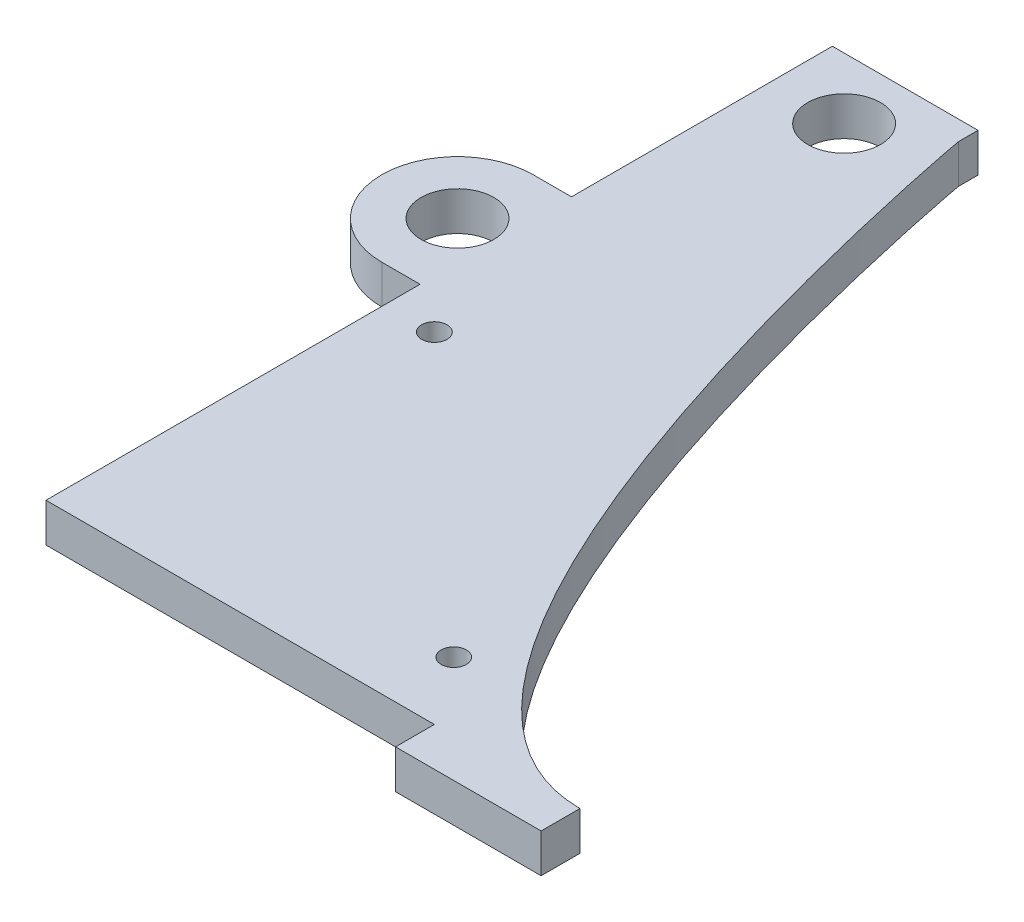
ISO-10303-21;
HEADER;
FILE_DESCRIPTION(('STEP AP214'),'2;1');
FILE_NAME('part.step','',(''),(''),'','','');
FILE_SCHEMA(('AUTOMOTIVE_DESIGN { 1 0 10303 214 1 1 1 1 }'));
ENDSEC;
DATA;
#1=APPLICATION_CONTEXT('core data for automotive mechanical design processes');
#2=APPLICATION_PROTOCOL_DEFINITION('international standard','automotive_design',2000,#1);
#3=PRODUCT_CONTEXT('',#1,'mechanical');
#4=PRODUCT('Part','Part','',(#3));
#5=PRODUCT_RELATED_PRODUCT_CATEGORY('part','',(#4));
#6=PRODUCT_DEFINITION_FORMATION('','',#4);
#7=PRODUCT_DEFINITION_CONTEXT('part definition',#1,'design');
#8=PRODUCT_DEFINITION('design','',#6,#7);
#9=PRODUCT_DEFINITION_SHAPE('','',#8);
#10=(LENGTH_UNIT() NAMED_UNIT(*) SI_UNIT(.MILLI.,.METRE.));
#11=(NAMED_UNIT(*) PLANE_ANGLE_UNIT() SI_UNIT($,.RADIAN.));
#12=(NAMED_UNIT(*) SI_UNIT($,.STERADIAN.) SOLID_ANGLE_UNIT());
#13=UNCERTAINTY_MEASURE_WITH_UNIT(LENGTH_MEASURE(1.E-05),#10,'distance_accuracy_value','');
#14=(GEOMETRIC_REPRESENTATION_CONTEXT(3) GLOBAL_UNCERTAINTY_ASSIGNED_CONTEXT((#13)) GLOBAL_UNIT_ASSIGNED_CONTEXT((#10,
#11,#12)) REPRESENTATION_CONTEXT('',''));
#15=CARTESIAN_POINT('',(0.,0.,0.));
#16=DIRECTION('',(0.,0.,1.));
#17=DIRECTION('',(1.,0.,0.));
#18=AXIS2_PLACEMENT_3D('',#15,#16,#17);
#19=CARTESIAN_POINT('',(-9.525,5.08,48.8950000000001));
#20=DIRECTION('',(1.,0.,0.));
#21=DIRECTION('',(0.,0.,-1.));
#22=AXIS2_PLACEMENT_3D('',#19,#20,#21);
#23=PLANE('',#22);
#24=DIRECTION('',(0.,0.,1.));
#25=VECTOR('',#24,1.);
#26=CARTESIAN_POINT('',(-9.525,5.08,48.8950000000001));
#27=LINE('',#26,#25);
#28=CARTESIAN_POINT('',(-9.52499999999999,5.08,-0.0375919999999405));
#29=VERTEX_POINT('',#28);
#30=CARTESIAN_POINT('',(-9.525,5.08,48.8950000000001));
#31=VERTEX_POINT('',#30);
#32=EDGE_CURVE('E56',#29,#31,#27,.T.);
#33=ORIENTED_EDGE('',*,*,#32,.F.);
#34=DIRECTION('',(0.,-1.,0.));
#35=VECTOR('',#34,1.);
#36=CARTESIAN_POINT('',(-9.52499999999998,5.08,-0.0375919999999405));
#37=LINE('',#36,#35);
#38=CARTESIAN_POINT('',(-9.52499999999999,0.,-0.0375919999999405));
#39=VERTEX_POINT('',#38);
#40=EDGE_CURVE('E169',#29,#39,#37,.T.);
#41=ORIENTED_EDGE('',*,*,#40,.T.);
#42=DIRECTION('',(0.,0.,1.));
#43=VECTOR('',#42,1.);
#44=CARTESIAN_POINT('',(-9.525,0.,48.8950000000001));
#45=LINE('',#44,#43);
#46=CARTESIAN_POINT('',(-9.525,0.,48.8950000000001));
#47=VERTEX_POINT('',#46);
#48=EDGE_CURVE('E460',#39,#47,#45,.T.);
#49=ORIENTED_EDGE('',*,*,#48,.T.);
#50=DIRECTION('',(0.,-1.,0.));
#51=VECTOR('',#50,1.);
#52=CARTESIAN_POINT('',(-9.525,5.08,48.8950000000001));
#53=LINE('',#52,#51);
#54=EDGE_CURVE('E480',#31,#47,#53,.T.);
#55=ORIENTED_EDGE('',*,*,#54,.F.);
#56=EDGE_LOOP('',(#33,#41,#49,#55));
#57=FACE_BOUND('',#56,.T.);
#58=ADVANCED_FACE('F41',(#57),#23,.F.);
#59=CARTESIAN_POINT('',(22.7352910938507,5.08,-1.18732961513015));
#60=DIRECTION('',(0.,-1.,0.));
#61=DIRECTION('',(0.,0.,-1.));
#62=AXIS2_PLACEMENT_3D('',#59,#60,#61);
#63=PLANE('',#62);
#64=DIRECTION('',(-1.,0.,0.));
#65=VECTOR('',#64,1.);
#66=CARTESIAN_POINT('',(-14.535912,5.08,-0.0375919999999405));
#67=LINE('',#66,#65);
#68=CARTESIAN_POINT('',(-14.535912,5.08,-0.0375919999999405));
#69=VERTEX_POINT('',#68);
#70=EDGE_CURVE('E141',#29,#69,#67,.T.);
#71=ORIENTED_EDGE('',*,*,#70,.F.);
#72=ORIENTED_EDGE('',*,*,#32,.T.);
#73=DIRECTION('',(1.,0.,0.));
#74=VECTOR('',#73,1.);
#75=CARTESIAN_POINT('',(60.325,5.08,48.8950000000001));
#76=LINE('',#75,#74);
#77=CARTESIAN_POINT('',(41.275,5.08,48.8950000000001));
#78=VERTEX_POINT('',#77);
#79=EDGE_CURVE('E221',#31,#78,#76,.T.);
#80=ORIENTED_EDGE('',*,*,#79,.T.);
#81=DIRECTION('',(0.,0.,1.));
#82=VECTOR('',#81,1.);
#83=CARTESIAN_POINT('',(41.275,5.08,48.8950000000001));
#84=LINE('',#83,#82);
#85=CARTESIAN_POINT('',(41.275,5.08,53.9750000000001));
#86=VERTEX_POINT('',#85);
#87=EDGE_CURVE('E188',#78,#86,#84,.T.);
#88=ORIENTED_EDGE('',*,*,#87,.T.);
#89=DIRECTION('',(1.,0.,0.));
#90=VECTOR('',#89,1.);
#91=CARTESIAN_POINT('',(60.325,5.08,53.9750000000001));
#92=LINE('',#91,#90);
#93=CARTESIAN_POINT('',(60.325,5.08,53.9750000000001));
#94=VERTEX_POINT('',#93);
#95=EDGE_CURVE('E184',#86,#94,#92,.T.);
#96=ORIENTED_EDGE('',*,*,#95,.T.);
#97=DIRECTION('',(0.,0.,-1.));
#98=VECTOR('',#97,1.);
#99=CARTESIAN_POINT('',(60.325,5.08,48.8950000000001));
#100=LINE('',#99,#98);
#101=CARTESIAN_POINT('',(60.325,5.08,48.8950000000001));
#102=VERTEX_POINT('',#101);
#103=EDGE_CURVE('E175',#94,#102,#100,.T.);
#104=ORIENTED_EDGE('',*,*,#103,.T.);
#105=CARTESIAN_POINT('',(60.325,5.08,48.895));
#106=CARTESIAN_POINT('',(27.8191095836019,5.08,48.895));
#107=CARTESIAN_POINT('',(9.525,5.08,-51.214545640347));
#108=CARTESIAN_POINT('',(9.525,5.08,-51.435));
#109=B_SPLINE_CURVE_WITH_KNOTS('',3,(#105,#106,#107,#108),.UNSPECIFIED.,.F.,.F.,(4,4),(0.,1.),.UNSPECIFIED.);
#110=CARTESIAN_POINT('',(9.525,5.08,-51.435));
#111=VERTEX_POINT('',#110);
#112=EDGE_CURVE('E224',#102,#111,#109,.T.);
#113=ORIENTED_EDGE('',*,*,#112,.T.);
#114=DIRECTION('',(0.,0.,-1.));
#115=VECTOR('',#114,1.);
#116=CARTESIAN_POINT('',(9.525,5.08,-51.435));
#117=LINE('',#116,#115);
#118=CARTESIAN_POINT('',(9.52499999999999,5.08,-53.9749999999999));
#119=VERTEX_POINT('',#118);
#120=EDGE_CURVE('E214',#111,#119,#117,.T.);
#121=ORIENTED_EDGE('',*,*,#120,.T.);
#122=DIRECTION('',(-1.,0.,0.));
#123=VECTOR('',#122,1.);
#124=CARTESIAN_POINT('',(-9.52499999999998,5.08,-53.9749999999999));
#125=LINE('',#124,#123);
#126=CARTESIAN_POINT('',(-9.52499999999998,5.08,-53.9749999999999));
#127=VERTEX_POINT('',#126);
#128=EDGE_CURVE('E217',#119,#127,#125,.T.);
#129=ORIENTED_EDGE('',*,*,#128,.T.);
#130=CARTESIAN_POINT('',(-9.52499999999999,5.08,-19.8495919999999));
#131=VERTEX_POINT('',#130);
#132=EDGE_CURVE('E150',#127,#131,#27,.T.);
#133=ORIENTED_EDGE('',*,*,#132,.T.);
#134=DIRECTION('',(1.,0.,0.));
#135=VECTOR('',#134,1.);
#136=CARTESIAN_POINT('',(-14.535912,5.08,-19.8495919999999));
#137=LINE('',#136,#135);
#138=CARTESIAN_POINT('',(-14.535912,5.08,-19.8495919999999));
#139=VERTEX_POINT('',#138);
#140=EDGE_CURVE('E134',#139,#131,#137,.T.);
#141=ORIENTED_EDGE('',*,*,#140,.F.);
#142=CARTESIAN_POINT('',(-14.535912,5.08,-9.94359199999994));
#143=DIRECTION('',(0.,-1.,0.));
#144=DIRECTION('',(0.,0.,-1.));
#145=AXIS2_PLACEMENT_3D('',#142,#143,#144);
#146=CIRCLE('',#145,9.906);
#147=EDGE_CURVE('E148',#69,#139,#146,.T.);
#148=ORIENTED_EDGE('',*,*,#147,.F.);
#149=EDGE_LOOP('',(#71,#72,#80,#88,#96,#104,#113,#121,#129,#133,#141,#148));
#150=FACE_BOUND('',#149,.T.);
#151=CARTESIAN_POINT('',(34.925,5.08,40.0050000000001));
#152=DIRECTION('',(0.,-1.,0.));
#153=DIRECTION('',(0.,0.,-1.));
#154=AXIS2_PLACEMENT_3D('',#151,#152,#153);
#155=CIRCLE('',#154,1.651);
#156=CARTESIAN_POINT('',(34.925,5.08,38.3540000000001));
#157=VERTEX_POINT('',#156);
#158=EDGE_CURVE('E172',#157,#157,#155,.T.);
#159=ORIENTED_EDGE('',*,*,#158,.T.);
#160=EDGE_LOOP('',(#159));
#161=FACE_BOUND('',#160,.T.);
#162=CARTESIAN_POINT('',(-3.17499999999998,5.08,4.44500000000005));
#163=DIRECTION('',(0.,-1.,0.));
#164=DIRECTION('',(0.,0.,-1.));
#165=AXIS2_PLACEMENT_3D('',#162,#163,#164);
#166=CIRCLE('',#165,1.66072838208594);
#167=CARTESIAN_POINT('',(-3.17499999999998,5.08,2.78427161791411));
#168=VERTEX_POINT('',#167);
#169=EDGE_CURVE('E168',#168,#168,#166,.T.);
#170=ORIENTED_EDGE('',*,*,#169,.T.);
#171=EDGE_LOOP('',(#170));
#172=FACE_BOUND('',#171,.T.);
#173=CARTESIAN_POINT('',(0.,5.08,-45.9866999999999));
#174=DIRECTION('',(0.,1.,0.));
#175=DIRECTION('',(0.,0.,1.));
#176=AXIS2_PLACEMENT_3D('',#173,#174,#175);
#177=CIRCLE('',#176,4.7625);
#178=CARTESIAN_POINT('',(0.,5.08,-41.2241999999999));
#179=VERTEX_POINT('',#178);
#180=EDGE_CURVE('E208',#179,#179,#177,.T.);
#181=ORIENTED_EDGE('',*,*,#180,.F.);
#182=EDGE_LOOP('',(#181));
#183=FACE_BOUND('',#182,.T.);
#184=CARTESIAN_POINT('',(-14.535912,5.08,-9.94359199999994));
#185=DIRECTION('',(0.,-1.,0.));
#186=DIRECTION('',(0.,0.,-1.));
#187=AXIS2_PLACEMENT_3D('',#184,#185,#186);
#188=CIRCLE('',#187,4.7625);
#189=CARTESIAN_POINT('',(-14.535912,5.08,-14.7060919999999));
#190=VERTEX_POINT('',#189);
#191=EDGE_CURVE('E165',#190,#190,#188,.T.);
#192=ORIENTED_EDGE('',*,*,#191,.T.);
#193=EDGE_LOOP('',(#192));
#194=FACE_BOUND('',#193,.T.);
#195=ADVANCED_FACE('F146',(#150,#161,#172,#183,#194),#63,.F.);
#196=CARTESIAN_POINT('',(22.7352910938507,0.,-1.18732961513015));
#197=DIRECTION('',(0.,-1.,0.));
#198=DIRECTION('',(0.,0.,-1.));
#199=AXIS2_PLACEMENT_3D('',#196,#197,#198);
#200=PLANE('',#199);
#201=ORIENTED_EDGE('',*,*,#48,.F.);
#202=DIRECTION('',(-1.,0.,0.));
#203=VECTOR('',#202,1.);
#204=CARTESIAN_POINT('',(-14.535912,0.,-0.0375919999999405));
#205=LINE('',#204,#203);
#206=CARTESIAN_POINT('',(-14.535912,0.,-0.0375919999999405));
#207=VERTEX_POINT('',#206);
#208=EDGE_CURVE('E154',#39,#207,#205,.T.);
#209=ORIENTED_EDGE('',*,*,#208,.T.);
#210=CARTESIAN_POINT('',(-14.535912,0.,-9.94359199999994));
#211=DIRECTION('',(0.,-1.,0.));
#212=DIRECTION('',(0.,0.,-1.));
#213=AXIS2_PLACEMENT_3D('',#210,#211,#212);
#214=CIRCLE('',#213,9.906);
#215=CARTESIAN_POINT('',(-14.535912,0.,-19.8495919999999));
#216=VERTEX_POINT('',#215);
#217=EDGE_CURVE('E163',#207,#216,#214,.T.);
#218=ORIENTED_EDGE('',*,*,#217,.T.);
#219=DIRECTION('',(1.,0.,0.));
#220=VECTOR('',#219,1.);
#221=CARTESIAN_POINT('',(-14.535912,0.,-19.8495919999999));
#222=LINE('',#221,#220);
#223=CARTESIAN_POINT('',(-9.52499999999999,0.,-19.8495919999999));
#224=VERTEX_POINT('',#223);
#225=EDGE_CURVE('E136',#216,#224,#222,.T.);
#226=ORIENTED_EDGE('',*,*,#225,.T.);
#227=CARTESIAN_POINT('',(-9.52499999999998,0.,-53.9749999999999));
#228=VERTEX_POINT('',#227);
#229=EDGE_CURVE('E464',#228,#224,#45,.T.);
#230=ORIENTED_EDGE('',*,*,#229,.F.);
#231=DIRECTION('',(-1.,0.,0.));
#232=VECTOR('',#231,1.);
#233=CARTESIAN_POINT('',(-9.52499999999998,0.,-53.9749999999999));
#234=LINE('',#233,#232);
#235=CARTESIAN_POINT('',(9.52499999999999,0.,-53.9749999999999));
#236=VERTEX_POINT('',#235);
#237=EDGE_CURVE('E465',#236,#228,#234,.T.);
#238=ORIENTED_EDGE('',*,*,#237,.F.);
#239=DIRECTION('',(0.,0.,-1.));
#240=VECTOR('',#239,1.);
#241=CARTESIAN_POINT('',(9.525,0.,-51.435));
#242=LINE('',#241,#240);
#243=CARTESIAN_POINT('',(9.525,0.,-51.435));
#244=VERTEX_POINT('',#243);
#245=EDGE_CURVE('E211',#244,#236,#242,.T.);
#246=ORIENTED_EDGE('',*,*,#245,.F.);
#247=CARTESIAN_POINT('',(60.325,0.,48.895));
#248=CARTESIAN_POINT('',(27.8191095836019,0.,48.895));
#249=CARTESIAN_POINT('',(9.525,0.,-51.214545640347));
#250=CARTESIAN_POINT('',(9.525,0.,-51.435));
#251=B_SPLINE_CURVE_WITH_KNOTS('',3,(#247,#248,#249,#250),.UNSPECIFIED.,.F.,.F.,(4,4),(0.,1.),.UNSPECIFIED.);
#252=CARTESIAN_POINT('',(60.325,0.,48.8950000000001));
#253=VERTEX_POINT('',#252);
#254=EDGE_CURVE('E218',#253,#244,#251,.T.);
#255=ORIENTED_EDGE('',*,*,#254,.F.);
#256=DIRECTION('',(0.,0.,-1.));
#257=VECTOR('',#256,1.);
#258=CARTESIAN_POINT('',(60.325,0.,48.8950000000001));
#259=LINE('',#258,#257);
#260=CARTESIAN_POINT('',(60.325,0.,53.9750000000001));
#261=VERTEX_POINT('',#260);
#262=EDGE_CURVE('E193',#261,#253,#259,.T.);
#263=ORIENTED_EDGE('',*,*,#262,.F.);
#264=DIRECTION('',(1.,0.,0.));
#265=VECTOR('',#264,1.);
#266=CARTESIAN_POINT('',(60.325,0.,53.9750000000001));
#267=LINE('',#266,#265);
#268=CARTESIAN_POINT('',(41.275,0.,53.9750000000001));
#269=VERTEX_POINT('',#268);
#270=EDGE_CURVE('E197',#269,#261,#267,.T.);
#271=ORIENTED_EDGE('',*,*,#270,.F.);
#272=DIRECTION('',(0.,0.,1.));
#273=VECTOR('',#272,1.);
#274=CARTESIAN_POINT('',(41.275,0.,48.8950000000001));
#275=LINE('',#274,#273);
#276=CARTESIAN_POINT('',(41.275,0.,48.8950000000001));
#277=VERTEX_POINT('',#276);
#278=EDGE_CURVE('E201',#277,#269,#275,.T.);
#279=ORIENTED_EDGE('',*,*,#278,.F.);
#280=DIRECTION('',(1.,0.,0.));
#281=VECTOR('',#280,1.);
#282=CARTESIAN_POINT('',(60.325,0.,48.8950000000001));
#283=LINE('',#282,#281);
#284=EDGE_CURVE('E462',#47,#277,#283,.T.);
#285=ORIENTED_EDGE('',*,*,#284,.F.);
#286=EDGE_LOOP('',(#201,#209,#218,#226,#230,#238,#246,#255,#263,#271,#279,#285));
#287=FACE_BOUND('',#286,.T.);
#288=CARTESIAN_POINT('',(34.925,0.,40.0050000000001));
#289=DIRECTION('',(0.,-1.,0.));
#290=DIRECTION('',(0.,0.,-1.));
#291=AXIS2_PLACEMENT_3D('',#288,#289,#290);
#292=CIRCLE('',#291,1.651);
#293=CARTESIAN_POINT('',(34.925,0.,38.3540000000001));
#294=VERTEX_POINT('',#293);
#295=EDGE_CURVE('E176',#294,#294,#292,.T.);
#296=ORIENTED_EDGE('',*,*,#295,.F.);
#297=EDGE_LOOP('',(#296));
#298=FACE_BOUND('',#297,.T.);
#299=CARTESIAN_POINT('',(-3.17499999999998,0.,4.44500000000005));
#300=DIRECTION('',(0.,-1.,0.));
#301=DIRECTION('',(0.,0.,-1.));
#302=AXIS2_PLACEMENT_3D('',#299,#300,#301);
#303=CIRCLE('',#302,1.66072838208594);
#304=CARTESIAN_POINT('',(-3.17499999999998,0.,2.78427161791411));
#305=VERTEX_POINT('',#304);
#306=EDGE_CURVE('E179',#305,#305,#303,.T.);
#307=ORIENTED_EDGE('',*,*,#306,.F.);
#308=EDGE_LOOP('',(#307));
#309=FACE_BOUND('',#308,.T.);
#310=CARTESIAN_POINT('',(0.,0.,-45.9866999999999));
#311=DIRECTION('',(0.,1.,0.));
#312=DIRECTION('',(0.,0.,1.));
#313=AXIS2_PLACEMENT_3D('',#310,#311,#312);
#314=CIRCLE('',#313,4.7625);
#315=CARTESIAN_POINT('',(0.,0.,-41.2241999999999));
#316=VERTEX_POINT('',#315);
#317=EDGE_CURVE('E195',#316,#316,#314,.T.);
#318=ORIENTED_EDGE('',*,*,#317,.T.);
#319=EDGE_LOOP('',(#318));
#320=FACE_BOUND('',#319,.T.);
#321=CARTESIAN_POINT('',(-14.535912,0.,-9.94359199999994));
#322=DIRECTION('',(0.,-1.,0.));
#323=DIRECTION('',(0.,0.,-1.));
#324=AXIS2_PLACEMENT_3D('',#321,#322,#323);
#325=CIRCLE('',#324,4.7625);
#326=CARTESIAN_POINT('',(-14.535912,0.,-14.7060919999999));
#327=VERTEX_POINT('',#326);
#328=EDGE_CURVE('E159',#327,#327,#325,.T.);
#329=ORIENTED_EDGE('',*,*,#328,.F.);
#330=EDGE_LOOP('',(#329));
#331=FACE_BOUND('',#330,.T.);
#332=ADVANCED_FACE('F242',(#287,#298,#309,#320,#331),#200,.T.);
#333=CARTESIAN_POINT('',(9.525,5.08,-51.435));
#334=DIRECTION('',(-1.,0.,0.));
#335=DIRECTION('',(0.,0.,1.));
#336=AXIS2_PLACEMENT_3D('',#333,#334,#335);
#337=PLANE('',#336);
#338=ORIENTED_EDGE('',*,*,#245,.T.);
#339=DIRECTION('',(0.,-1.,0.));
#340=VECTOR('',#339,1.);
#341=CARTESIAN_POINT('',(9.52499999999999,5.08,-53.9749999999999));
#342=LINE('',#341,#340);
#343=EDGE_CURVE('E11',#119,#236,#342,.T.);
#344=ORIENTED_EDGE('',*,*,#343,.F.);
#345=ORIENTED_EDGE('',*,*,#120,.F.);
#346=DIRECTION('',(0.,-1.,0.));
#347=VECTOR('',#346,1.);
#348=CARTESIAN_POINT('',(9.525,5.08,-51.435));
#349=LINE('',#348,#347);
#350=EDGE_CURVE('E229',#111,#244,#349,.T.);
#351=ORIENTED_EDGE('',*,*,#350,.T.);
#352=EDGE_LOOP('',(#338,#344,#345,#351));
#353=FACE_BOUND('',#352,.T.);
#354=ADVANCED_FACE('F43',(#353),#337,.F.);
#355=CARTESIAN_POINT('',(-9.52499999999998,5.08,-53.9749999999999));
#356=DIRECTION('',(0.,0.,1.));
#357=DIRECTION('',(1.,0.,0.));
#358=AXIS2_PLACEMENT_3D('',#355,#356,#357);
#359=PLANE('',#358);
#360=ORIENTED_EDGE('',*,*,#237,.T.);
#361=DIRECTION('',(0.,-1.,0.));
#362=VECTOR('',#361,1.);
#363=CARTESIAN_POINT('',(-9.52499999999998,5.08,-53.9749999999999));
#364=LINE('',#363,#362);
#365=EDGE_CURVE('E49',#127,#228,#364,.T.);
#366=ORIENTED_EDGE('',*,*,#365,.F.);
#367=ORIENTED_EDGE('',*,*,#128,.F.);
#368=ORIENTED_EDGE('',*,*,#343,.T.);
#369=EDGE_LOOP('',(#360,#366,#367,#368));
#370=FACE_BOUND('',#369,.T.);
#371=ADVANCED_FACE('F249',(#370),#359,.F.);
#372=ORIENTED_EDGE('',*,*,#229,.T.);
#373=DIRECTION('',(0.,-1.,0.));
#374=VECTOR('',#373,1.);
#375=CARTESIAN_POINT('',(-9.52499999999998,5.08,-19.8495919999999));
#376=LINE('',#375,#374);
#377=EDGE_CURVE('E64',#131,#224,#376,.T.);
#378=ORIENTED_EDGE('',*,*,#377,.F.);
#379=ORIENTED_EDGE('',*,*,#132,.F.);
#380=ORIENTED_EDGE('',*,*,#365,.T.);
#381=EDGE_LOOP('',(#372,#378,#379,#380));
#382=FACE_BOUND('',#381,.T.);
#383=ADVANCED_FACE('F246',(#382),#23,.F.);
#384=CARTESIAN_POINT('',(60.325,5.08,48.8950000000001));
#385=DIRECTION('',(0.,0.,-1.));
#386=DIRECTION('',(-1.,0.,0.));
#387=AXIS2_PLACEMENT_3D('',#384,#385,#386);
#388=PLANE('',#387);
#389=ORIENTED_EDGE('',*,*,#284,.T.);
#390=DIRECTION('',(0.,1.,0.));
#391=VECTOR('',#390,1.);
#392=CARTESIAN_POINT('',(41.275,-19.7157018642502,48.8950000000001));
#393=LINE('',#392,#391);
#394=EDGE_CURVE('E187',#277,#78,#393,.T.);
#395=ORIENTED_EDGE('',*,*,#394,.T.);
#396=ORIENTED_EDGE('',*,*,#79,.F.);
#397=ORIENTED_EDGE('',*,*,#54,.T.);
#398=EDGE_LOOP('',(#389,#395,#396,#397));
#399=FACE_BOUND('',#398,.T.);
#400=ADVANCED_FACE('F240',(#399),#388,.F.);
#401=DIRECTION('',(0.,-1.,0.));
#402=VECTOR('',#401,1.);
#403=SURFACE_OF_LINEAR_EXTRUSION('',#109,#402);
#404=ORIENTED_EDGE('',*,*,#254,.T.);
#405=ORIENTED_EDGE('',*,*,#350,.F.);
#406=ORIENTED_EDGE('',*,*,#112,.F.);
#407=DIRECTION('',(0.,-1.,0.));
#408=VECTOR('',#407,1.);
#409=CARTESIAN_POINT('',(60.325,5.08,48.8950000000001));
#410=LINE('',#409,#408);
#411=EDGE_CURVE('E477',#102,#253,#410,.T.);
#412=ORIENTED_EDGE('',*,*,#411,.T.);
#413=EDGE_LOOP('',(#404,#405,#406,#412));
#414=FACE_BOUND('',#413,.T.);
#415=ADVANCED_FACE('F235',(#414),#403,.F.);
#416=CARTESIAN_POINT('',(0.,5.08,-45.9866999999999));
#417=DIRECTION('',(0.,-1.,0.));
#418=DIRECTION('',(0.,0.,-1.));
#419=AXIS2_PLACEMENT_3D('',#416,#417,#418);
#420=CYLINDRICAL_SURFACE('',#419,4.7625);
#421=ORIENTED_EDGE('',*,*,#180,.T.);
#422=EDGE_LOOP('',(#421));
#423=FACE_BOUND('',#422,.T.);
#424=ORIENTED_EDGE('',*,*,#317,.F.);
#425=EDGE_LOOP('',(#424));
#426=FACE_BOUND('',#425,.T.);
#427=ADVANCED_FACE('F239',(#423,#426),#420,.F.);
#428=CARTESIAN_POINT('',(41.275,-19.7157018642502,48.8950000000001));
#429=DIRECTION('',(-1.,0.,0.));
#430=DIRECTION('',(0.,0.,1.));
#431=AXIS2_PLACEMENT_3D('',#428,#429,#430);
#432=PLANE('',#431);
#433=ORIENTED_EDGE('',*,*,#394,.F.);
#434=ORIENTED_EDGE('',*,*,#278,.T.);
#435=DIRECTION('',(0.,1.,0.));
#436=VECTOR('',#435,1.);
#437=CARTESIAN_POINT('',(41.275,-19.7157018642502,53.9750000000001));
#438=LINE('',#437,#436);
#439=EDGE_CURVE('E200',#269,#86,#438,.T.);
#440=ORIENTED_EDGE('',*,*,#439,.T.);
#441=ORIENTED_EDGE('',*,*,#87,.F.);
#442=EDGE_LOOP('',(#433,#434,#440,#441));
#443=FACE_BOUND('',#442,.T.);
#444=ADVANCED_FACE('F269',(#443),#432,.T.);
#445=CARTESIAN_POINT('',(60.325,-19.7157018642502,53.9750000000001));
#446=DIRECTION('',(0.,0.,1.));
#447=DIRECTION('',(1.,0.,0.));
#448=AXIS2_PLACEMENT_3D('',#445,#446,#447);
#449=PLANE('',#448);
#450=ORIENTED_EDGE('',*,*,#439,.F.);
#451=ORIENTED_EDGE('',*,*,#270,.T.);
#452=DIRECTION('',(0.,1.,0.));
#453=VECTOR('',#452,1.);
#454=CARTESIAN_POINT('',(60.325,-19.7157018642502,53.9750000000001));
#455=LINE('',#454,#453);
#456=EDGE_CURVE('E196',#261,#94,#455,.T.);
#457=ORIENTED_EDGE('',*,*,#456,.T.);
#458=ORIENTED_EDGE('',*,*,#95,.F.);
#459=EDGE_LOOP('',(#450,#451,#457,#458));
#460=FACE_BOUND('',#459,.T.);
#461=ADVANCED_FACE('F273',(#460),#449,.T.);
#462=CARTESIAN_POINT('',(60.325,-19.7157018642502,48.8950000000001));
#463=DIRECTION('',(1.,0.,0.));
#464=DIRECTION('',(0.,0.,-1.));
#465=AXIS2_PLACEMENT_3D('',#462,#463,#464);
#466=PLANE('',#465);
#467=ORIENTED_EDGE('',*,*,#456,.F.);
#468=ORIENTED_EDGE('',*,*,#262,.T.);
#469=ORIENTED_EDGE('',*,*,#411,.F.);
#470=ORIENTED_EDGE('',*,*,#103,.F.);
#471=EDGE_LOOP('',(#467,#468,#469,#470));
#472=FACE_BOUND('',#471,.T.);
#473=ADVANCED_FACE('F277',(#472),#466,.T.);
#474=CARTESIAN_POINT('',(-3.17499999999998,5.08,4.44500000000005));
#475=DIRECTION('',(0.,-1.,0.));
#476=DIRECTION('',(0.,0.,-1.));
#477=AXIS2_PLACEMENT_3D('',#474,#475,#476);
#478=CYLINDRICAL_SURFACE('',#477,1.66072838208594);
#479=ORIENTED_EDGE('',*,*,#169,.F.);
#480=EDGE_LOOP('',(#479));
#481=FACE_BOUND('',#480,.T.);
#482=ORIENTED_EDGE('',*,*,#306,.T.);
#483=EDGE_LOOP('',(#482));
#484=FACE_BOUND('',#483,.T.);
#485=ADVANCED_FACE('F281',(#481,#484),#478,.F.);
#486=CARTESIAN_POINT('',(34.925,5.08,40.0050000000001));
#487=DIRECTION('',(0.,-1.,0.));
#488=DIRECTION('',(0.,0.,-1.));
#489=AXIS2_PLACEMENT_3D('',#486,#487,#488);
#490=CYLINDRICAL_SURFACE('',#489,1.651);
#491=ORIENTED_EDGE('',*,*,#158,.F.);
#492=EDGE_LOOP('',(#491));
#493=FACE_BOUND('',#492,.T.);
#494=ORIENTED_EDGE('',*,*,#295,.T.);
#495=EDGE_LOOP('',(#494));
#496=FACE_BOUND('',#495,.T.);
#497=ADVANCED_FACE('F285',(#493,#496),#490,.F.);
#498=CARTESIAN_POINT('',(-14.535912,5.08,-9.94359199999994));
#499=DIRECTION('',(0.,-1.,0.));
#500=DIRECTION('',(0.,0.,-1.));
#501=AXIS2_PLACEMENT_3D('',#498,#499,#500);
#502=CYLINDRICAL_SURFACE('',#501,9.906);
#503=ORIENTED_EDGE('',*,*,#217,.F.);
#504=DIRECTION('',(0.,-1.,0.));
#505=VECTOR('',#504,1.);
#506=CARTESIAN_POINT('',(-14.535912,5.08,-0.0375919999999405));
#507=LINE('',#506,#505);
#508=EDGE_CURVE('E153',#69,#207,#507,.T.);
#509=ORIENTED_EDGE('',*,*,#508,.F.);
#510=ORIENTED_EDGE('',*,*,#147,.T.);
#511=DIRECTION('',(0.,-1.,0.));
#512=VECTOR('',#511,1.);
#513=CARTESIAN_POINT('',(-14.535912,5.08,-19.8495919999999));
#514=LINE('',#513,#512);
#515=EDGE_CURVE('E131',#139,#216,#514,.T.);
#516=ORIENTED_EDGE('',*,*,#515,.T.);
#517=EDGE_LOOP('',(#503,#509,#510,#516));
#518=FACE_BOUND('',#517,.T.);
#519=ADVANCED_FACE('F152',(#518),#502,.T.);
#520=CARTESIAN_POINT('',(-14.535912,5.08,-0.0375919999999405));
#521=DIRECTION('',(0.,0.,1.));
#522=DIRECTION('',(1.,0.,0.));
#523=AXIS2_PLACEMENT_3D('',#520,#521,#522);
#524=PLANE('',#523);
#525=ORIENTED_EDGE('',*,*,#208,.F.);
#526=ORIENTED_EDGE('',*,*,#40,.F.);
#527=ORIENTED_EDGE('',*,*,#70,.T.);
#528=ORIENTED_EDGE('',*,*,#508,.T.);
#529=EDGE_LOOP('',(#525,#526,#527,#528));
#530=FACE_BOUND('',#529,.T.);
#531=ADVANCED_FACE('F292',(#530),#524,.T.);
#532=CARTESIAN_POINT('',(-14.535912,5.08,-19.8495919999999));
#533=DIRECTION('',(0.,0.,-1.));
#534=DIRECTION('',(-1.,0.,0.));
#535=AXIS2_PLACEMENT_3D('',#532,#533,#534);
#536=PLANE('',#535);
#537=ORIENTED_EDGE('',*,*,#225,.F.);
#538=ORIENTED_EDGE('',*,*,#515,.F.);
#539=ORIENTED_EDGE('',*,*,#140,.T.);
#540=ORIENTED_EDGE('',*,*,#377,.T.);
#541=EDGE_LOOP('',(#537,#538,#539,#540));
#542=FACE_BOUND('',#541,.T.);
#543=ADVANCED_FACE('F133',(#542),#536,.T.);
#544=CARTESIAN_POINT('',(-14.535912,5.08,-9.94359199999994));
#545=DIRECTION('',(0.,-1.,0.));
#546=DIRECTION('',(0.,0.,-1.));
#547=AXIS2_PLACEMENT_3D('',#544,#545,#546);
#548=CYLINDRICAL_SURFACE('',#547,4.7625);
#549=ORIENTED_EDGE('',*,*,#191,.F.);
#550=EDGE_LOOP('',(#549));
#551=FACE_BOUND('',#550,.T.);
#552=ORIENTED_EDGE('',*,*,#328,.T.);
#553=EDGE_LOOP('',(#552));
#554=FACE_BOUND('',#553,.T.);
#555=ADVANCED_FACE('F295',(#551,#554),#548,.F.);
#556=CLOSED_SHELL('',(#58,#195,#332,#354,#371,#383,#400,#415,#427,#444,#461,#473,#485,#497,#519,
#531,#543,#555));
#557=MANIFOLD_SOLID_BREP('B2',#556);
#558=ADVANCED_BREP_SHAPE_REPRESENTATION('',(#18,#557),#14);
#559=SHAPE_DEFINITION_REPRESENTATION(#9,#558);
ENDSEC;
END-ISO-10303-21;
